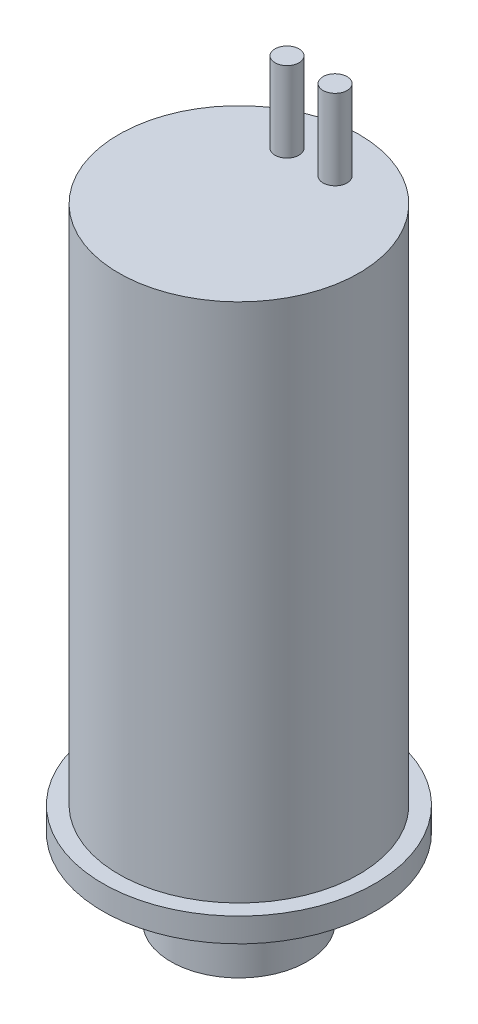
ISO-10303-21;
HEADER;
FILE_DESCRIPTION(('STEP AP214'),'2;1');
FILE_NAME('part.step','',(''),(''),'','','');
FILE_SCHEMA(('AUTOMOTIVE_DESIGN { 1 0 10303 214 1 1 1 1 }'));
ENDSEC;
DATA;
#1=APPLICATION_CONTEXT('core data for automotive mechanical design processes');
#2=APPLICATION_PROTOCOL_DEFINITION('international standard','automotive_design',2000,#1);
#3=PRODUCT_CONTEXT('',#1,'mechanical');
#4=PRODUCT('Part','Part','',(#3));
#5=PRODUCT_RELATED_PRODUCT_CATEGORY('part','',(#4));
#6=PRODUCT_DEFINITION_FORMATION('','',#4);
#7=PRODUCT_DEFINITION_CONTEXT('part definition',#1,'design');
#8=PRODUCT_DEFINITION('design','',#6,#7);
#9=PRODUCT_DEFINITION_SHAPE('','',#8);
#10=(LENGTH_UNIT() NAMED_UNIT(*) SI_UNIT(.MILLI.,.METRE.));
#11=(NAMED_UNIT(*) PLANE_ANGLE_UNIT() SI_UNIT($,.RADIAN.));
#12=(NAMED_UNIT(*) SI_UNIT($,.STERADIAN.) SOLID_ANGLE_UNIT());
#13=UNCERTAINTY_MEASURE_WITH_UNIT(LENGTH_MEASURE(1.E-05),#10,'distance_accuracy_value','');
#14=(GEOMETRIC_REPRESENTATION_CONTEXT(3) GLOBAL_UNCERTAINTY_ASSIGNED_CONTEXT((#13)) GLOBAL_UNIT_ASSIGNED_CONTEXT((#10,
#11,#12)) REPRESENTATION_CONTEXT('',''));
#15=CARTESIAN_POINT('',(0.,0.,0.));
#16=DIRECTION('',(0.,0.,1.));
#17=DIRECTION('',(1.,0.,0.));
#18=AXIS2_PLACEMENT_3D('',#15,#16,#17);
#19=CARTESIAN_POINT('',(-4.25,5.5,0.));
#20=DIRECTION('',(0.,1.,0.));
#21=DIRECTION('',(0.,0.,1.));
#22=AXIS2_PLACEMENT_3D('',#19,#20,#21);
#23=PLANE('',#22);
#24=CARTESIAN_POINT('',(0.,5.5,0.));
#25=DIRECTION('',(0.,-1.,0.));
#26=DIRECTION('',(0.,0.,-1.));
#27=AXIS2_PLACEMENT_3D('',#24,#25,#26);
#28=CIRCLE('',#27,8.5);
#29=CARTESIAN_POINT('',(0.,5.5,-8.5));
#30=VERTEX_POINT('',#29);
#31=EDGE_CURVE('E52',#30,#30,#28,.T.);
#32=ORIENTED_EDGE('',*,*,#31,.T.);
#33=EDGE_LOOP('',(#32));
#34=FACE_BOUND('',#33,.T.);
#35=CARTESIAN_POINT('',(0.,5.5,0.));
#36=DIRECTION('',(0.,-1.,0.));
#37=DIRECTION('',(0.,0.,-1.));
#38=AXIS2_PLACEMENT_3D('',#35,#36,#37);
#39=CIRCLE('',#38,7.63);
#40=CARTESIAN_POINT('',(0.,5.5,-7.63));
#41=VERTEX_POINT('',#40);
#42=EDGE_CURVE('E96',#41,#41,#39,.T.);
#43=ORIENTED_EDGE('',*,*,#42,.F.);
#44=EDGE_LOOP('',(#43));
#45=FACE_BOUND('',#44,.T.);
#46=ADVANCED_FACE('F37',(#34,#45),#23,.F.);
#47=CARTESIAN_POINT('',(0.,0.,0.));
#48=DIRECTION('',(0.,-1.,0.));
#49=DIRECTION('',(0.,0.,-1.));
#50=AXIS2_PLACEMENT_3D('',#47,#48,#49);
#51=CYLINDRICAL_SURFACE('',#50,8.5);
#52=ORIENTED_EDGE('',*,*,#31,.F.);
#53=EDGE_LOOP('',(#52));
#54=FACE_BOUND('',#53,.T.);
#55=CARTESIAN_POINT('',(0.,7.,0.));
#56=DIRECTION('',(0.,-1.,0.));
#57=DIRECTION('',(0.,0.,-1.));
#58=AXIS2_PLACEMENT_3D('',#55,#56,#57);
#59=CIRCLE('',#58,8.5);
#60=CARTESIAN_POINT('',(0.,7.,-8.5));
#61=VERTEX_POINT('',#60);
#62=EDGE_CURVE('E57',#61,#61,#59,.T.);
#63=ORIENTED_EDGE('',*,*,#62,.T.);
#64=EDGE_LOOP('',(#63));
#65=FACE_BOUND('',#64,.T.);
#66=ADVANCED_FACE('F103',(#54,#65),#51,.T.);
#67=CARTESIAN_POINT('',(-8.5,7.,0.));
#68=DIRECTION('',(0.,-1.,0.));
#69=DIRECTION('',(0.,0.,-1.));
#70=AXIS2_PLACEMENT_3D('',#67,#68,#69);
#71=PLANE('',#70);
#72=ORIENTED_EDGE('',*,*,#62,.F.);
#73=EDGE_LOOP('',(#72));
#74=FACE_BOUND('',#73,.T.);
#75=CARTESIAN_POINT('',(0.,7.,0.));
#76=DIRECTION('',(0.,-1.,0.));
#77=DIRECTION('',(0.,0.,-1.));
#78=AXIS2_PLACEMENT_3D('',#75,#76,#77);
#79=CIRCLE('',#78,7.5);
#80=CARTESIAN_POINT('',(0.,7.,-7.5));
#81=VERTEX_POINT('',#80);
#82=EDGE_CURVE('E60',#81,#81,#79,.T.);
#83=ORIENTED_EDGE('',*,*,#82,.T.);
#84=EDGE_LOOP('',(#83));
#85=FACE_BOUND('',#84,.T.);
#86=ADVANCED_FACE('F112',(#74,#85),#71,.F.);
#87=CARTESIAN_POINT('',(0.,0.,0.));
#88=DIRECTION('',(0.,-1.,0.));
#89=DIRECTION('',(0.,0.,-1.));
#90=AXIS2_PLACEMENT_3D('',#87,#88,#89);
#91=CYLINDRICAL_SURFACE('',#90,7.5);
#92=ORIENTED_EDGE('',*,*,#82,.F.);
#93=EDGE_LOOP('',(#92));
#94=FACE_BOUND('',#93,.T.);
#95=CARTESIAN_POINT('',(0.,39.5,0.));
#96=DIRECTION('',(0.,-1.,0.));
#97=DIRECTION('',(0.,0.,-1.));
#98=AXIS2_PLACEMENT_3D('',#95,#96,#97);
#99=CIRCLE('',#98,7.5);
#100=CARTESIAN_POINT('',(0.,39.5,-7.5));
#101=VERTEX_POINT('',#100);
#102=EDGE_CURVE('E63',#101,#101,#99,.T.);
#103=ORIENTED_EDGE('',*,*,#102,.T.);
#104=EDGE_LOOP('',(#103));
#105=FACE_BOUND('',#104,.T.);
#106=ADVANCED_FACE('F176',(#94,#105),#91,.T.);
#107=CARTESIAN_POINT('',(-7.5,39.5,0.));
#108=DIRECTION('',(0.,-1.,0.));
#109=DIRECTION('',(0.,0.,-1.));
#110=AXIS2_PLACEMENT_3D('',#107,#108,#109);
#111=PLANE('',#110);
#112=CARTESIAN_POINT('',(1.5,39.5,-4.5));
#113=DIRECTION('',(0.,-1.,0.));
#114=DIRECTION('',(0.,0.,-1.));
#115=AXIS2_PLACEMENT_3D('',#112,#113,#114);
#116=CIRCLE('',#115,0.75);
#117=CARTESIAN_POINT('',(1.5,39.5,-5.25));
#118=VERTEX_POINT('',#117);
#119=EDGE_CURVE('E10',#118,#118,#116,.F.);
#120=ORIENTED_EDGE('',*,*,#119,.F.);
#121=EDGE_LOOP('',(#120));
#122=FACE_BOUND('',#121,.T.);
#123=CARTESIAN_POINT('',(-1.5,39.5,-4.5));
#124=DIRECTION('',(0.,-1.,0.));
#125=DIRECTION('',(0.,0.,-1.));
#126=AXIS2_PLACEMENT_3D('',#123,#124,#125);
#127=CIRCLE('',#126,0.75);
#128=CARTESIAN_POINT('',(-1.5,39.5,-5.25));
#129=VERTEX_POINT('',#128);
#130=EDGE_CURVE('E44',#129,#129,#127,.F.);
#131=ORIENTED_EDGE('',*,*,#130,.F.);
#132=EDGE_LOOP('',(#131));
#133=FACE_BOUND('',#132,.T.);
#134=ORIENTED_EDGE('',*,*,#102,.F.);
#135=EDGE_LOOP('',(#134));
#136=FACE_BOUND('',#135,.T.);
#137=ADVANCED_FACE('F169',(#122,#133,#136),#111,.F.);
#138=CARTESIAN_POINT('',(-1.5,44.5,-4.5));
#139=DIRECTION('',(0.,-1.,0.));
#140=DIRECTION('',(0.,0.,-1.));
#141=AXIS2_PLACEMENT_3D('',#138,#139,#140);
#142=CYLINDRICAL_SURFACE('',#141,0.75);
#143=CARTESIAN_POINT('',(-1.5,44.5,-4.5));
#144=DIRECTION('',(0.,1.,0.));
#145=DIRECTION('',(0.,0.,1.));
#146=AXIS2_PLACEMENT_3D('',#143,#144,#145);
#147=CIRCLE('',#146,0.75);
#148=CARTESIAN_POINT('',(-1.5,44.5,-3.75));
#149=VERTEX_POINT('',#148);
#150=EDGE_CURVE('E67',#149,#149,#147,.T.);
#151=ORIENTED_EDGE('',*,*,#150,.F.);
#152=EDGE_LOOP('',(#151));
#153=FACE_BOUND('',#152,.T.);
#154=ORIENTED_EDGE('',*,*,#130,.T.);
#155=EDGE_LOOP('',(#154));
#156=FACE_BOUND('',#155,.T.);
#157=ADVANCED_FACE('F166',(#153,#156),#142,.T.);
#158=CARTESIAN_POINT('',(-1.5,44.5,-4.5));
#159=DIRECTION('',(0.,1.,0.));
#160=DIRECTION('',(0.,0.,1.));
#161=AXIS2_PLACEMENT_3D('',#158,#159,#160);
#162=PLANE('',#161);
#163=ORIENTED_EDGE('',*,*,#150,.T.);
#164=EDGE_LOOP('',(#163));
#165=FACE_BOUND('',#164,.T.);
#166=ADVANCED_FACE('F164',(#165),#162,.T.);
#167=CARTESIAN_POINT('',(1.5,44.5,-4.5));
#168=DIRECTION('',(0.,-1.,0.));
#169=DIRECTION('',(0.,0.,-1.));
#170=AXIS2_PLACEMENT_3D('',#167,#168,#169);
#171=CYLINDRICAL_SURFACE('',#170,0.75);
#172=CARTESIAN_POINT('',(1.5,44.5,-4.5));
#173=DIRECTION('',(0.,1.,0.));
#174=DIRECTION('',(0.,0.,1.));
#175=AXIS2_PLACEMENT_3D('',#172,#173,#174);
#176=CIRCLE('',#175,0.75);
#177=CARTESIAN_POINT('',(1.5,44.5,-3.75));
#178=VERTEX_POINT('',#177);
#179=EDGE_CURVE('E66',#178,#178,#176,.T.);
#180=ORIENTED_EDGE('',*,*,#179,.F.);
#181=EDGE_LOOP('',(#180));
#182=FACE_BOUND('',#181,.T.);
#183=ORIENTED_EDGE('',*,*,#119,.T.);
#184=EDGE_LOOP('',(#183));
#185=FACE_BOUND('',#184,.T.);
#186=ADVANCED_FACE('F145',(#182,#185),#171,.T.);
#187=CARTESIAN_POINT('',(1.5,44.5,-4.5));
#188=DIRECTION('',(0.,1.,0.));
#189=DIRECTION('',(0.,0.,1.));
#190=AXIS2_PLACEMENT_3D('',#187,#188,#189);
#191=PLANE('',#190);
#192=ORIENTED_EDGE('',*,*,#179,.T.);
#193=EDGE_LOOP('',(#192));
#194=FACE_BOUND('',#193,.T.);
#195=ADVANCED_FACE('F140',(#194),#191,.T.);
#196=CARTESIAN_POINT('',(0.,0.,0.));
#197=DIRECTION('',(0.,-1.,0.));
#198=DIRECTION('',(0.,0.,-1.));
#199=AXIS2_PLACEMENT_3D('',#196,#197,#198);
#200=CYLINDRICAL_SURFACE('',#199,7.63);
#201=CARTESIAN_POINT('',(0.,6.4,0.));
#202=DIRECTION('',(0.,-1.,0.));
#203=DIRECTION('',(0.,0.,-1.));
#204=AXIS2_PLACEMENT_3D('',#201,#202,#203);
#205=CIRCLE('',#204,7.63);
#206=CARTESIAN_POINT('',(0.,6.4,-7.63));
#207=VERTEX_POINT('',#206);
#208=EDGE_CURVE('E85',#207,#207,#205,.T.);
#209=ORIENTED_EDGE('',*,*,#208,.F.);
#210=EDGE_LOOP('',(#209));
#211=FACE_BOUND('',#210,.T.);
#212=ORIENTED_EDGE('',*,*,#42,.T.);
#213=EDGE_LOOP('',(#212));
#214=FACE_BOUND('',#213,.T.);
#215=ADVANCED_FACE('F100',(#211,#214),#200,.F.);
#216=CARTESIAN_POINT('',(0.,6.4,-7.63));
#217=DIRECTION('',(0.,1.,0.));
#218=DIRECTION('',(0.,0.,1.));
#219=AXIS2_PLACEMENT_3D('',#216,#217,#218);
#220=PLANE('',#219);
#221=CARTESIAN_POINT('',(0.,6.4,0.));
#222=DIRECTION('',(0.,-1.,0.));
#223=DIRECTION('',(0.,0.,-1.));
#224=AXIS2_PLACEMENT_3D('',#221,#222,#223);
#225=CIRCLE('',#224,6.5);
#226=CARTESIAN_POINT('',(0.,6.4,-6.5));
#227=VERTEX_POINT('',#226);
#228=EDGE_CURVE('E90',#227,#227,#225,.T.);
#229=ORIENTED_EDGE('',*,*,#228,.F.);
#230=EDGE_LOOP('',(#229));
#231=FACE_BOUND('',#230,.T.);
#232=ORIENTED_EDGE('',*,*,#208,.T.);
#233=EDGE_LOOP('',(#232));
#234=FACE_BOUND('',#233,.T.);
#235=ADVANCED_FACE('F131',(#231,#234),#220,.F.);
#236=CARTESIAN_POINT('',(0.,0.,0.));
#237=DIRECTION('',(0.,-1.,0.));
#238=DIRECTION('',(0.,0.,-1.));
#239=AXIS2_PLACEMENT_3D('',#236,#237,#238);
#240=CYLINDRICAL_SURFACE('',#239,6.5);
#241=CARTESIAN_POINT('',(0.,5.5,0.));
#242=DIRECTION('',(0.,-1.,0.));
#243=DIRECTION('',(0.,0.,-1.));
#244=AXIS2_PLACEMENT_3D('',#241,#242,#243);
#245=CIRCLE('',#244,6.5);
#246=CARTESIAN_POINT('',(0.,5.5,-6.5));
#247=VERTEX_POINT('',#246);
#248=EDGE_CURVE('E93',#247,#247,#245,.T.);
#249=ORIENTED_EDGE('',*,*,#248,.F.);
#250=EDGE_LOOP('',(#249));
#251=FACE_BOUND('',#250,.T.);
#252=ORIENTED_EDGE('',*,*,#228,.T.);
#253=EDGE_LOOP('',(#252));
#254=FACE_BOUND('',#253,.T.);
#255=ADVANCED_FACE('F128',(#251,#254),#240,.T.);
#256=CARTESIAN_POINT('',(0.,7.5,0.));
#257=DIRECTION('',(0.,-1.,0.));
#258=DIRECTION('',(0.,0.,-1.));
#259=AXIS2_PLACEMENT_3D('',#256,#257,#258);
#260=PLANE('',#259);
#261=CARTESIAN_POINT('',(0.,7.5,0.));
#262=DIRECTION('',(0.,-1.,0.));
#263=DIRECTION('',(0.,0.,-1.));
#264=AXIS2_PLACEMENT_3D('',#261,#262,#263);
#265=CIRCLE('',#264,1.17);
#266=CARTESIAN_POINT('',(0.,7.5,-1.17));
#267=VERTEX_POINT('',#266);
#268=EDGE_CURVE('E81',#267,#267,#265,.T.);
#269=ORIENTED_EDGE('',*,*,#268,.T.);
#270=EDGE_LOOP('',(#269));
#271=FACE_BOUND('',#270,.T.);
#272=ADVANCED_FACE('F130',(#271),#260,.T.);
#273=CARTESIAN_POINT('',(0.,7.5,0.));
#274=DIRECTION('',(0.,-1.,0.));
#275=DIRECTION('',(0.,0.,-1.));
#276=AXIS2_PLACEMENT_3D('',#273,#274,#275);
#277=CYLINDRICAL_SURFACE('',#276,1.17);
#278=ORIENTED_EDGE('',*,*,#268,.F.);
#279=EDGE_LOOP('',(#278));
#280=FACE_BOUND('',#279,.T.);
#281=CARTESIAN_POINT('',(0.,0.,0.));
#282=DIRECTION('',(0.,-1.,0.));
#283=DIRECTION('',(0.,0.,-1.));
#284=AXIS2_PLACEMENT_3D('',#281,#282,#283);
#285=CIRCLE('',#284,1.17);
#286=CARTESIAN_POINT('',(0.,0.,-1.17));
#287=VERTEX_POINT('',#286);
#288=EDGE_CURVE('E82',#287,#287,#285,.T.);
#289=ORIENTED_EDGE('',*,*,#288,.T.);
#290=EDGE_LOOP('',(#289));
#291=FACE_BOUND('',#290,.T.);
#292=ADVANCED_FACE('F150',(#280,#291),#277,.F.);
#293=CARTESIAN_POINT('',(0.,0.,0.));
#294=DIRECTION('',(0.,1.,0.));
#295=DIRECTION('',(0.,0.,1.));
#296=AXIS2_PLACEMENT_3D('',#293,#294,#295);
#297=PLANE('',#296);
#298=ORIENTED_EDGE('',*,*,#288,.F.);
#299=EDGE_LOOP('',(#298));
#300=FACE_BOUND('',#299,.T.);
#301=CARTESIAN_POINT('',(0.,0.,0.));
#302=DIRECTION('',(0.,-1.,0.));
#303=DIRECTION('',(0.,0.,-1.));
#304=AXIS2_PLACEMENT_3D('',#301,#302,#303);
#305=CIRCLE('',#304,3.26);
#306=CARTESIAN_POINT('',(0.,0.,-3.26));
#307=VERTEX_POINT('',#306);
#308=EDGE_CURVE('E78',#307,#307,#305,.T.);
#309=ORIENTED_EDGE('',*,*,#308,.T.);
#310=EDGE_LOOP('',(#309));
#311=FACE_BOUND('',#310,.T.);
#312=ADVANCED_FACE('F39',(#300,#311),#297,.F.);
#313=CARTESIAN_POINT('',(0.,0.,0.));
#314=DIRECTION('',(0.,-1.,0.));
#315=DIRECTION('',(0.,0.,-1.));
#316=AXIS2_PLACEMENT_3D('',#313,#314,#315);
#317=CYLINDRICAL_SURFACE('',#316,3.26);
#318=ORIENTED_EDGE('',*,*,#308,.F.);
#319=EDGE_LOOP('',(#318));
#320=FACE_BOUND('',#319,.T.);
#321=CARTESIAN_POINT('',(0.,0.65,0.));
#322=DIRECTION('',(0.,-1.,0.));
#323=DIRECTION('',(0.,0.,-1.));
#324=AXIS2_PLACEMENT_3D('',#321,#322,#323);
#325=CIRCLE('',#324,3.26);
#326=CARTESIAN_POINT('',(0.,0.65,-3.26));
#327=VERTEX_POINT('',#326);
#328=EDGE_CURVE('E75',#327,#327,#325,.T.);
#329=ORIENTED_EDGE('',*,*,#328,.T.);
#330=EDGE_LOOP('',(#329));
#331=FACE_BOUND('',#330,.T.);
#332=ADVANCED_FACE('F155',(#320,#331),#317,.T.);
#333=CARTESIAN_POINT('',(0.,0.65,-4.25));
#334=DIRECTION('',(0.,1.,0.));
#335=DIRECTION('',(0.,0.,1.));
#336=AXIS2_PLACEMENT_3D('',#333,#334,#335);
#337=PLANE('',#336);
#338=ORIENTED_EDGE('',*,*,#328,.F.);
#339=EDGE_LOOP('',(#338));
#340=FACE_BOUND('',#339,.T.);
#341=CARTESIAN_POINT('',(0.,0.65,0.));
#342=DIRECTION('',(0.,-1.,0.));
#343=DIRECTION('',(0.,0.,-1.));
#344=AXIS2_PLACEMENT_3D('',#341,#342,#343);
#345=CIRCLE('',#344,4.25);
#346=CARTESIAN_POINT('',(0.,0.65,-4.25));
#347=VERTEX_POINT('',#346);
#348=EDGE_CURVE('E70',#347,#347,#345,.T.);
#349=ORIENTED_EDGE('',*,*,#348,.T.);
#350=EDGE_LOOP('',(#349));
#351=FACE_BOUND('',#350,.T.);
#352=ADVANCED_FACE('F122',(#340,#351),#337,.F.);
#353=CARTESIAN_POINT('',(0.,0.,0.));
#354=DIRECTION('',(0.,-1.,0.));
#355=DIRECTION('',(0.,0.,-1.));
#356=AXIS2_PLACEMENT_3D('',#353,#354,#355);
#357=CYLINDRICAL_SURFACE('',#356,4.25);
#358=ORIENTED_EDGE('',*,*,#348,.F.);
#359=EDGE_LOOP('',(#358));
#360=FACE_BOUND('',#359,.T.);
#361=CARTESIAN_POINT('',(0.,5.5,0.));
#362=DIRECTION('',(0.,-1.,0.));
#363=DIRECTION('',(0.,0.,-1.));
#364=AXIS2_PLACEMENT_3D('',#361,#362,#363);
#365=CIRCLE('',#364,4.25);
#366=CARTESIAN_POINT('',(0.,5.5,-4.25));
#367=VERTEX_POINT('',#366);
#368=EDGE_CURVE('E48',#367,#367,#365,.T.);
#369=ORIENTED_EDGE('',*,*,#368,.T.);
#370=EDGE_LOOP('',(#369));
#371=FACE_BOUND('',#370,.T.);
#372=ADVANCED_FACE('F116',(#360,#371),#357,.T.);
#373=ORIENTED_EDGE('',*,*,#368,.F.);
#374=EDGE_LOOP('',(#373));
#375=FACE_BOUND('',#374,.T.);
#376=ORIENTED_EDGE('',*,*,#248,.T.);
#377=EDGE_LOOP('',(#376));
#378=FACE_BOUND('',#377,.T.);
#379=ADVANCED_FACE('F106',(#375,#378),#23,.F.);
#380=CLOSED_SHELL('',(#46,#66,#86,#106,#137,#157,#166,#186,#195,#215,#235,#255,#272,#292,#312,
#332,#352,#372,#379));
#381=MANIFOLD_SOLID_BREP('B2',#380);
#382=ADVANCED_BREP_SHAPE_REPRESENTATION('',(#18,#381),#14);
#383=SHAPE_DEFINITION_REPRESENTATION(#9,#382);
ENDSEC;
END-ISO-10303-21;
